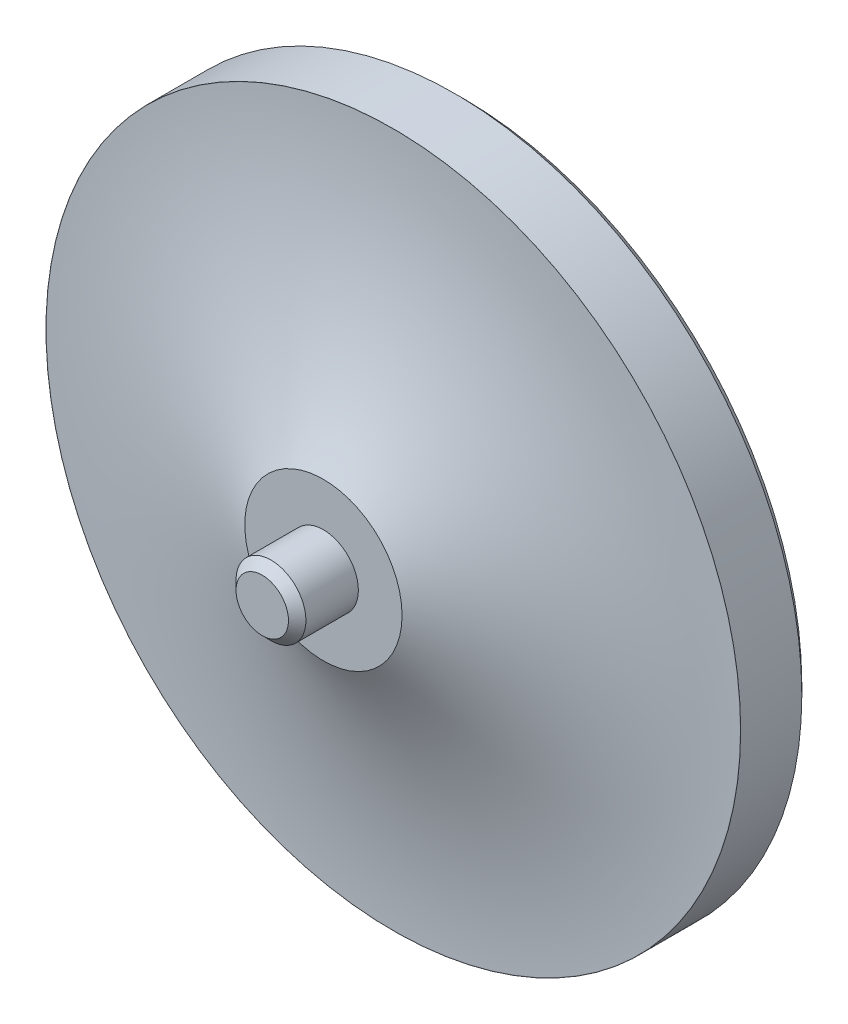
ISO-10303-21;
HEADER;
FILE_DESCRIPTION(('STEP AP214'),'2;1');
FILE_NAME('part.step','',(''),(''),'','','');
FILE_SCHEMA(('AUTOMOTIVE_DESIGN { 1 0 10303 214 1 1 1 1 }'));
ENDSEC;
DATA;
#1=APPLICATION_CONTEXT('core data for automotive mechanical design processes');
#2=APPLICATION_PROTOCOL_DEFINITION('international standard','automotive_design',2000,#1);
#3=PRODUCT_CONTEXT('',#1,'mechanical');
#4=PRODUCT('Part','Part','',(#3));
#5=PRODUCT_RELATED_PRODUCT_CATEGORY('part','',(#4));
#6=PRODUCT_DEFINITION_FORMATION('','',#4);
#7=PRODUCT_DEFINITION_CONTEXT('part definition',#1,'design');
#8=PRODUCT_DEFINITION('design','',#6,#7);
#9=PRODUCT_DEFINITION_SHAPE('','',#8);
#10=(LENGTH_UNIT() NAMED_UNIT(*) SI_UNIT(.MILLI.,.METRE.));
#11=(NAMED_UNIT(*) PLANE_ANGLE_UNIT() SI_UNIT($,.RADIAN.));
#12=(NAMED_UNIT(*) SI_UNIT($,.STERADIAN.) SOLID_ANGLE_UNIT());
#13=UNCERTAINTY_MEASURE_WITH_UNIT(LENGTH_MEASURE(1.E-05),#10,'distance_accuracy_value','');
#14=(GEOMETRIC_REPRESENTATION_CONTEXT(3) GLOBAL_UNCERTAINTY_ASSIGNED_CONTEXT((#13)) GLOBAL_UNIT_ASSIGNED_CONTEXT((#10,
#11,#12)) REPRESENTATION_CONTEXT('',''));
#15=CARTESIAN_POINT('',(0.,0.,0.));
#16=DIRECTION('',(0.,0.,1.));
#17=DIRECTION('',(1.,0.,0.));
#18=AXIS2_PLACEMENT_3D('',#15,#16,#17);
#19=CARTESIAN_POINT('',(0.,0.,8.));
#20=DIRECTION('',(0.,0.,-1.));
#21=DIRECTION('',(-1.,0.,0.));
#22=AXIS2_PLACEMENT_3D('',#19,#20,#21);
#23=CYLINDRICAL_SURFACE('',#22,39.75);
#24=CARTESIAN_POINT('',(0.,0.,0.999999999999994));
#25=DIRECTION('',(0.,0.,1.));
#26=DIRECTION('',(1.,0.,0.));
#27=AXIS2_PLACEMENT_3D('',#24,#25,#26);
#28=CIRCLE('',#27,39.75);
#29=CARTESIAN_POINT('',(39.75,0.,0.999999999999994));
#30=VERTEX_POINT('',#29);
#31=EDGE_CURVE('E71',#30,#30,#28,.T.);
#32=ORIENTED_EDGE('',*,*,#31,.T.);
#33=EDGE_LOOP('',(#32));
#34=FACE_BOUND('',#33,.T.);
#35=CARTESIAN_POINT('',(0.,0.,8.));
#36=DIRECTION('',(0.,0.,1.));
#37=DIRECTION('',(1.,0.,0.));
#38=AXIS2_PLACEMENT_3D('',#35,#36,#37);
#39=CIRCLE('',#38,39.75);
#40=CARTESIAN_POINT('',(39.75,0.,8.));
#41=VERTEX_POINT('',#40);
#42=EDGE_CURVE('E75',#41,#41,#39,.T.);
#43=ORIENTED_EDGE('',*,*,#42,.F.);
#44=EDGE_LOOP('',(#43));
#45=FACE_BOUND('',#44,.T.);
#46=ADVANCED_FACE('F45',(#34,#45),#23,.T.);
#47=CARTESIAN_POINT('',(0.,0.,8.));
#48=DIRECTION('',(0.,0.,1.));
#49=DIRECTION('',(1.,0.,0.));
#50=AXIS2_PLACEMENT_3D('',#47,#48,#49);
#51=PLANE('',#50);
#52=CARTESIAN_POINT('',(0.,0.,8.00000000000001));
#53=DIRECTION('',(0.,0.,1.));
#54=DIRECTION('',(1.,0.,0.));
#55=AXIS2_PLACEMENT_3D('',#52,#53,#54);
#56=CIRCLE('',#55,39.7245829914744);
#57=CARTESIAN_POINT('',(39.7245829914744,0.,8.00000000000001));
#58=VERTEX_POINT('',#57);
#59=EDGE_CURVE('E59',#58,#58,#56,.F.);
#60=ORIENTED_EDGE('',*,*,#59,.T.);
#61=EDGE_LOOP('',(#60));
#62=FACE_BOUND('',#61,.T.);
#63=ORIENTED_EDGE('',*,*,#42,.T.);
#64=EDGE_LOOP('',(#63));
#65=FACE_BOUND('',#64,.T.);
#66=ADVANCED_FACE('F109',(#62,#65),#51,.T.);
#67=CARTESIAN_POINT('',(0.,0.,0.));
#68=DIRECTION('',(0.,0.,1.));
#69=DIRECTION('',(1.,0.,0.));
#70=AXIS2_PLACEMENT_3D('',#67,#68,#69);
#71=PLANE('',#70);
#72=CARTESIAN_POINT('',(0.,0.,0.));
#73=DIRECTION('',(0.,0.,1.));
#74=DIRECTION('',(1.,0.,0.));
#75=AXIS2_PLACEMENT_3D('',#72,#73,#74);
#76=CIRCLE('',#75,38.75);
#77=CARTESIAN_POINT('',(38.75,0.,0.));
#78=VERTEX_POINT('',#77);
#79=EDGE_CURVE('E67',#78,#78,#76,.F.);
#80=ORIENTED_EDGE('',*,*,#79,.T.);
#81=EDGE_LOOP('',(#80));
#82=FACE_BOUND('',#81,.T.);
#83=ADVANCED_FACE('F115',(#82),#71,.F.);
#84=CARTESIAN_POINT('',(0.,0.,0.999999999999994));
#85=DIRECTION('',(0.,0.,1.));
#86=DIRECTION('',(1.,0.,0.));
#87=AXIS2_PLACEMENT_3D('',#84,#85,#86);
#88=CONICAL_SURFACE('',#87,39.75,0.785398163397452);
#89=ORIENTED_EDGE('',*,*,#79,.F.);
#90=EDGE_LOOP('',(#89));
#91=FACE_BOUND('',#90,.T.);
#92=ORIENTED_EDGE('',*,*,#31,.F.);
#93=EDGE_LOOP('',(#92));
#94=FACE_BOUND('',#93,.T.);
#95=ADVANCED_FACE('F92',(#91,#94),#88,.T.);
#96=CARTESIAN_POINT('',(0.,0.,16.));
#97=DIRECTION('',(0.,0.,1.));
#98=DIRECTION('',(1.,0.,0.));
#99=AXIS2_PLACEMENT_3D('',#96,#97,#98);
#100=PLANE('',#99);
#101=CARTESIAN_POINT('',(0.,0.,16.));
#102=DIRECTION('',(0.,0.,1.));
#103=DIRECTION('',(1.,0.,0.));
#104=AXIS2_PLACEMENT_3D('',#101,#102,#103);
#105=CIRCLE('',#104,4.);
#106=CARTESIAN_POINT('',(4.,0.,16.));
#107=VERTEX_POINT('',#106);
#108=EDGE_CURVE('E64',#107,#107,#105,.T.);
#109=ORIENTED_EDGE('',*,*,#108,.F.);
#110=EDGE_LOOP('',(#109));
#111=FACE_BOUND('',#110,.T.);
#112=CARTESIAN_POINT('',(0.,0.,16.));
#113=DIRECTION('',(0.,0.,1.));
#114=DIRECTION('',(1.,0.,0.));
#115=AXIS2_PLACEMENT_3D('',#112,#113,#114);
#116=CIRCLE('',#115,9.);
#117=CARTESIAN_POINT('',(9.,0.,16.));
#118=VERTEX_POINT('',#117);
#119=EDGE_CURVE('E79',#118,#118,#116,.T.);
#120=ORIENTED_EDGE('',*,*,#119,.T.);
#121=EDGE_LOOP('',(#120));
#122=FACE_BOUND('',#121,.T.);
#123=ADVANCED_FACE('F89',(#111,#122),#100,.T.);
#124=CARTESIAN_POINT('',(0.,0.,23.));
#125=DIRECTION('',(0.,0.,-1.));
#126=DIRECTION('',(-1.,0.,0.));
#127=AXIS2_PLACEMENT_3D('',#124,#125,#126);
#128=CYLINDRICAL_SURFACE('',#127,4.);
#129=CARTESIAN_POINT('',(0.,0.,22.));
#130=DIRECTION('',(0.,0.,1.));
#131=DIRECTION('',(1.,0.,0.));
#132=AXIS2_PLACEMENT_3D('',#129,#130,#131);
#133=CIRCLE('',#132,4.);
#134=CARTESIAN_POINT('',(4.,0.,22.));
#135=VERTEX_POINT('',#134);
#136=EDGE_CURVE('E10',#135,#135,#133,.F.);
#137=ORIENTED_EDGE('',*,*,#136,.T.);
#138=EDGE_LOOP('',(#137));
#139=FACE_BOUND('',#138,.T.);
#140=ORIENTED_EDGE('',*,*,#108,.T.);
#141=EDGE_LOOP('',(#140));
#142=FACE_BOUND('',#141,.T.);
#143=ADVANCED_FACE('F87',(#139,#142),#128,.T.);
#144=CARTESIAN_POINT('',(0.,0.,23.));
#145=DIRECTION('',(0.,0.,1.));
#146=DIRECTION('',(1.,0.,0.));
#147=AXIS2_PLACEMENT_3D('',#144,#145,#146);
#148=PLANE('',#147);
#149=CARTESIAN_POINT('',(0.,0.,23.));
#150=DIRECTION('',(0.,0.,1.));
#151=DIRECTION('',(1.,0.,0.));
#152=AXIS2_PLACEMENT_3D('',#149,#150,#151);
#153=CIRCLE('',#152,3.00000000000002);
#154=CARTESIAN_POINT('',(3.00000000000002,0.,23.));
#155=VERTEX_POINT('',#154);
#156=EDGE_CURVE('E54',#155,#155,#153,.T.);
#157=ORIENTED_EDGE('',*,*,#156,.T.);
#158=EDGE_LOOP('',(#157));
#159=FACE_BOUND('',#158,.T.);
#160=ADVANCED_FACE('F98',(#159),#148,.T.);
#161=CARTESIAN_POINT('',(0.,0.,71.));
#162=DIRECTION('',(0.,0.,1.));
#163=DIRECTION('',(1.,0.,0.));
#164=AXIS2_PLACEMENT_3D('',#161,#162,#163);
#165=DEGENERATE_TOROIDAL_SURFACE('',#164,39.7245829914744,63.,.T.);
#166=ORIENTED_EDGE('',*,*,#59,.F.);
#167=EDGE_LOOP('',(#166));
#168=FACE_BOUND('',#167,.T.);
#169=ORIENTED_EDGE('',*,*,#119,.F.);
#170=EDGE_LOOP('',(#169));
#171=FACE_BOUND('',#170,.T.);
#172=ADVANCED_FACE('F96',(#168,#171),#165,.F.);
#173=CARTESIAN_POINT('',(0.,0.,23.));
#174=DIRECTION('',(0.,0.,-1.));
#175=DIRECTION('',(-1.,0.,0.));
#176=AXIS2_PLACEMENT_3D('',#173,#174,#175);
#177=CONICAL_SURFACE('',#176,3.00000000000002,0.785398163397441);
#178=ORIENTED_EDGE('',*,*,#136,.F.);
#179=EDGE_LOOP('',(#178));
#180=FACE_BOUND('',#179,.T.);
#181=ORIENTED_EDGE('',*,*,#156,.F.);
#182=EDGE_LOOP('',(#181));
#183=FACE_BOUND('',#182,.T.);
#184=ADVANCED_FACE('F48',(#180,#183),#177,.T.);
#185=CLOSED_SHELL('',(#46,#66,#83,#95,#123,#143,#160,#172,#184));
#186=MANIFOLD_SOLID_BREP('B2',#185);
#187=ADVANCED_BREP_SHAPE_REPRESENTATION('',(#18,#186),#14);
#188=SHAPE_DEFINITION_REPRESENTATION(#9,#187);
ENDSEC;
END-ISO-10303-21;
